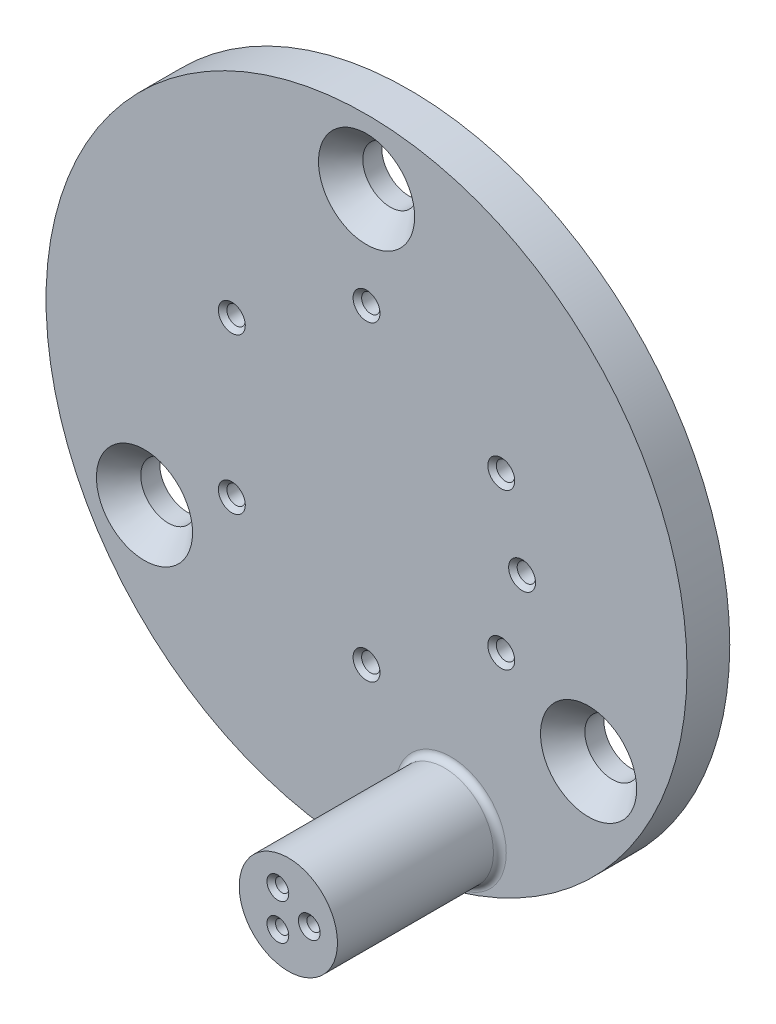
ISO-10303-21;
HEADER;
FILE_DESCRIPTION(('STEP AP214'),'2;1');
FILE_NAME('part.step','',(''),(''),'','','');
FILE_SCHEMA(('AUTOMOTIVE_DESIGN { 1 0 10303 214 1 1 1 1 }'));
ENDSEC;
DATA;
#1=APPLICATION_CONTEXT('core data for automotive mechanical design processes');
#2=APPLICATION_PROTOCOL_DEFINITION('international standard','automotive_design',2000,#1);
#3=PRODUCT_CONTEXT('',#1,'mechanical');
#4=PRODUCT('Part','Part','',(#3));
#5=PRODUCT_RELATED_PRODUCT_CATEGORY('part','',(#4));
#6=PRODUCT_DEFINITION_FORMATION('','',#4);
#7=PRODUCT_DEFINITION_CONTEXT('part definition',#1,'design');
#8=PRODUCT_DEFINITION('design','',#6,#7);
#9=PRODUCT_DEFINITION_SHAPE('','',#8);
#10=(LENGTH_UNIT() NAMED_UNIT(*) SI_UNIT(.MILLI.,.METRE.));
#11=(NAMED_UNIT(*) PLANE_ANGLE_UNIT() SI_UNIT($,.RADIAN.));
#12=(NAMED_UNIT(*) SI_UNIT($,.STERADIAN.) SOLID_ANGLE_UNIT());
#13=UNCERTAINTY_MEASURE_WITH_UNIT(LENGTH_MEASURE(1.E-05),#10,'distance_accuracy_value','');
#14=(GEOMETRIC_REPRESENTATION_CONTEXT(3) GLOBAL_UNCERTAINTY_ASSIGNED_CONTEXT((#13)) GLOBAL_UNIT_ASSIGNED_CONTEXT((#10,
#11,#12)) REPRESENTATION_CONTEXT('',''));
#15=CARTESIAN_POINT('',(0.,0.,0.));
#16=DIRECTION('',(0.,0.,1.));
#17=DIRECTION('',(1.,0.,0.));
#18=AXIS2_PLACEMENT_3D('',#15,#16,#17);
#19=CARTESIAN_POINT('',(-17.766231697773,-20.0164888256698,2.54));
#20=DIRECTION('',(0.,0.,1.));
#21=DIRECTION('',(1.,0.,0.));
#22=AXIS2_PLACEMENT_3D('',#19,#20,#21);
#23=PLANE('',#22);
#24=CARTESIAN_POINT('',(-12.7624316977741,-34.8299265362313,2.54));
#25=DIRECTION('',(0.,0.,1.));
#26=DIRECTION('',(1.,0.,0.));
#27=AXIS2_PLACEMENT_3D('',#24,#25,#26);
#28=CIRCLE('',#27,3.302);
#29=CARTESIAN_POINT('',(-9.4604316977741,-34.8299265362313,2.54));
#30=VERTEX_POINT('',#29);
#31=EDGE_CURVE('E10',#30,#30,#28,.F.);
#32=ORIENTED_EDGE('',*,*,#31,.T.);
#33=EDGE_LOOP('',(#32));
#34=FACE_BOUND('',#33,.T.);
#35=CARTESIAN_POINT('',(-9.75930722454368,-15.4350620499822,2.54));
#36=DIRECTION('',(0.,0.,1.));
#37=DIRECTION('',(1.,0.,0.));
#38=AXIS2_PLACEMENT_3D('',#35,#36,#37);
#39=CIRCLE('',#38,0.800099999999998);
#40=CARTESIAN_POINT('',(-8.95920722454368,-15.4350620499822,2.54));
#41=VERTEX_POINT('',#40);
#42=EDGE_CURVE('E142',#41,#41,#39,.F.);
#43=ORIENTED_EDGE('',*,*,#42,.T.);
#44=EDGE_LOOP('',(#43));
#45=FACE_BOUND('',#44,.T.);
#46=CARTESIAN_POINT('',(-8.52063169777308,-20.0578620499822,2.54));
#47=DIRECTION('',(0.,0.,1.));
#48=DIRECTION('',(1.,0.,0.));
#49=AXIS2_PLACEMENT_3D('',#46,#47,#48);
#50=CIRCLE('',#49,0.800099999999998);
#51=CARTESIAN_POINT('',(-7.72053169777308,-20.0578620499822,2.54));
#52=VERTEX_POINT('',#51);
#53=EDGE_CURVE('E145',#52,#52,#50,.F.);
#54=ORIENTED_EDGE('',*,*,#53,.T.);
#55=EDGE_LOOP('',(#54));
#56=FACE_BOUND('',#55,.T.);
#57=CARTESIAN_POINT('',(-9.75930722454368,-24.6806620499822,2.54));
#58=DIRECTION('',(0.,0.,1.));
#59=DIRECTION('',(1.,0.,0.));
#60=AXIS2_PLACEMENT_3D('',#57,#58,#59);
#61=CIRCLE('',#60,0.800099999999998);
#62=CARTESIAN_POINT('',(-8.95920722454368,-24.6806620499822,2.54));
#63=VERTEX_POINT('',#62);
#64=EDGE_CURVE('E148',#63,#63,#61,.F.);
#65=ORIENTED_EDGE('',*,*,#64,.T.);
#66=EDGE_LOOP('',(#65));
#67=FACE_BOUND('',#66,.T.);
#68=CARTESIAN_POINT('',(-17.7662316977731,-29.3034620499822,2.54));
#69=DIRECTION('',(0.,0.,1.));
#70=DIRECTION('',(1.,0.,0.));
#71=AXIS2_PLACEMENT_3D('',#68,#69,#70);
#72=CIRCLE('',#71,0.800099999999998);
#73=CARTESIAN_POINT('',(-16.9661316977731,-29.3034620499822,2.54));
#74=VERTEX_POINT('',#73);
#75=EDGE_CURVE('E151',#74,#74,#72,.F.);
#76=ORIENTED_EDGE('',*,*,#75,.T.);
#77=EDGE_LOOP('',(#76));
#78=FACE_BOUND('',#77,.T.);
#79=CARTESIAN_POINT('',(-25.7731561710025,-24.6806620499822,2.54));
#80=DIRECTION('',(0.,0.,1.));
#81=DIRECTION('',(1.,0.,0.));
#82=AXIS2_PLACEMENT_3D('',#79,#80,#81);
#83=CIRCLE('',#82,0.800099999999998);
#84=CARTESIAN_POINT('',(-24.9730561710025,-24.6806620499822,2.54));
#85=VERTEX_POINT('',#84);
#86=EDGE_CURVE('E154',#85,#85,#83,.F.);
#87=ORIENTED_EDGE('',*,*,#86,.T.);
#88=EDGE_LOOP('',(#87));
#89=FACE_BOUND('',#88,.T.);
#90=CARTESIAN_POINT('',(-25.7731561710025,-15.4350620499822,2.54));
#91=DIRECTION('',(0.,0.,1.));
#92=DIRECTION('',(1.,0.,0.));
#93=AXIS2_PLACEMENT_3D('',#90,#91,#92);
#94=CIRCLE('',#93,0.800099999999998);
#95=CARTESIAN_POINT('',(-24.9730561710025,-15.4350620499822,2.54));
#96=VERTEX_POINT('',#95);
#97=EDGE_CURVE('E157',#96,#96,#94,.F.);
#98=ORIENTED_EDGE('',*,*,#97,.T.);
#99=EDGE_LOOP('',(#98));
#100=FACE_BOUND('',#99,.T.);
#101=CARTESIAN_POINT('',(-17.766231697773,-10.8122620499822,2.54));
#102=DIRECTION('',(0.,0.,1.));
#103=DIRECTION('',(1.,0.,0.));
#104=AXIS2_PLACEMENT_3D('',#101,#102,#103);
#105=CIRCLE('',#104,0.800099999999998);
#106=CARTESIAN_POINT('',(-16.966131697773,-10.8122620499822,2.54));
#107=VERTEX_POINT('',#106);
#108=EDGE_CURVE('E160',#107,#107,#105,.F.);
#109=ORIENTED_EDGE('',*,*,#108,.T.);
#110=EDGE_LOOP('',(#109));
#111=FACE_BOUND('',#110,.T.);
#112=CARTESIAN_POINT('',(-17.766231697773,-20.0164888256698,2.54));
#113=DIRECTION('',(0.,0.,1.));
#114=DIRECTION('',(1.,0.,0.));
#115=AXIS2_PLACEMENT_3D('',#112,#113,#114);
#116=CIRCLE('',#115,19.05);
#117=CARTESIAN_POINT('',(1.28376830222697,-20.0164888256698,2.54));
#118=VERTEX_POINT('',#117);
#119=EDGE_CURVE('E166',#118,#118,#116,.T.);
#120=ORIENTED_EDGE('',*,*,#119,.T.);
#121=EDGE_LOOP('',(#120));
#122=FACE_BOUND('',#121,.T.);
#123=CARTESIAN_POINT('',(-4.56800454409828,-27.6778620499823,2.54));
#124=DIRECTION('',(0.,0.,1.));
#125=DIRECTION('',(1.,0.,0.));
#126=AXIS2_PLACEMENT_3D('',#123,#124,#125);
#127=CIRCLE('',#126,2.8575);
#128=CARTESIAN_POINT('',(-1.71050454409828,-27.6778620499823,2.54));
#129=VERTEX_POINT('',#128);
#130=EDGE_CURVE('E178',#129,#129,#127,.T.);
#131=ORIENTED_EDGE('',*,*,#130,.F.);
#132=EDGE_LOOP('',(#131));
#133=FACE_BOUND('',#132,.T.);
#134=CARTESIAN_POINT('',(-17.7662316977731,-4.81786204998223,2.54));
#135=DIRECTION('',(0.,0.,1.));
#136=DIRECTION('',(1.,0.,0.));
#137=AXIS2_PLACEMENT_3D('',#134,#135,#136);
#138=CIRCLE('',#137,2.8575);
#139=CARTESIAN_POINT('',(-14.9087316977731,-4.81786204998223,2.54));
#140=VERTEX_POINT('',#139);
#141=EDGE_CURVE('E187',#140,#140,#138,.T.);
#142=ORIENTED_EDGE('',*,*,#141,.F.);
#143=EDGE_LOOP('',(#142));
#144=FACE_BOUND('',#143,.T.);
#145=CARTESIAN_POINT('',(-30.9644588514479,-27.6778620499823,2.54));
#146=DIRECTION('',(0.,0.,1.));
#147=DIRECTION('',(1.,0.,0.));
#148=AXIS2_PLACEMENT_3D('',#145,#146,#147);
#149=CIRCLE('',#148,2.8575);
#150=CARTESIAN_POINT('',(-28.1069588514479,-27.6778620499823,2.54));
#151=VERTEX_POINT('',#150);
#152=EDGE_CURVE('E196',#151,#151,#149,.T.);
#153=ORIENTED_EDGE('',*,*,#152,.F.);
#154=EDGE_LOOP('',(#153));
#155=FACE_BOUND('',#154,.T.);
#156=ADVANCED_FACE('F32',(#34,#45,#56,#67,#78,#89,#100,#111,#122,#133,#144,#155),#23,.T.);
#157=CARTESIAN_POINT('',(-17.766231697773,-20.0164888256698,2.54));
#158=DIRECTION('',(0.,0.,-1.));
#159=DIRECTION('',(-1.,0.,0.));
#160=AXIS2_PLACEMENT_3D('',#157,#158,#159);
#161=CYLINDRICAL_SURFACE('',#160,19.05);
#162=ORIENTED_EDGE('',*,*,#119,.F.);
#163=EDGE_LOOP('',(#162));
#164=FACE_BOUND('',#163,.T.);
#165=CARTESIAN_POINT('',(-17.766231697773,-20.0164888256698,0.));
#166=DIRECTION('',(0.,0.,1.));
#167=DIRECTION('',(1.,0.,0.));
#168=AXIS2_PLACEMENT_3D('',#165,#166,#167);
#169=CIRCLE('',#168,19.05);
#170=CARTESIAN_POINT('',(1.28376830222697,-20.0164888256698,0.));
#171=VERTEX_POINT('',#170);
#172=EDGE_CURVE('E167',#171,#171,#169,.T.);
#173=ORIENTED_EDGE('',*,*,#172,.T.);
#174=EDGE_LOOP('',(#173));
#175=FACE_BOUND('',#174,.T.);
#176=ADVANCED_FACE('F220',(#164,#175),#161,.T.);
#177=CARTESIAN_POINT('',(-17.766231697773,-20.0164888256698,0.));
#178=DIRECTION('',(0.,0.,1.));
#179=DIRECTION('',(1.,0.,0.));
#180=AXIS2_PLACEMENT_3D('',#177,#178,#179);
#181=PLANE('',#180);
#182=CARTESIAN_POINT('',(-13.3847316977741,-35.9077817537814,0.));
#183=DIRECTION('',(0.,0.,1.));
#184=DIRECTION('',(1.,0.,0.));
#185=AXIS2_PLACEMENT_3D('',#182,#183,#184);
#186=CIRCLE('',#185,0.647699999999987);
#187=CARTESIAN_POINT('',(-12.7370316977741,-35.9077817537814,0.));
#188=VERTEX_POINT('',#187);
#189=EDGE_CURVE('E76',#188,#188,#186,.T.);
#190=ORIENTED_EDGE('',*,*,#189,.T.);
#191=EDGE_LOOP('',(#190));
#192=FACE_BOUND('',#191,.T.);
#193=CARTESIAN_POINT('',(-11.5178316977741,-34.8299265362313,0.));
#194=DIRECTION('',(0.,0.,1.));
#195=DIRECTION('',(1.,0.,0.));
#196=AXIS2_PLACEMENT_3D('',#193,#194,#195);
#197=CIRCLE('',#196,0.647699999999987);
#198=CARTESIAN_POINT('',(-10.8701316977741,-34.8299265362313,0.));
#199=VERTEX_POINT('',#198);
#200=EDGE_CURVE('E79',#199,#199,#197,.T.);
#201=ORIENTED_EDGE('',*,*,#200,.T.);
#202=EDGE_LOOP('',(#201));
#203=FACE_BOUND('',#202,.T.);
#204=CARTESIAN_POINT('',(-13.3847316977741,-33.7520713186812,0.));
#205=DIRECTION('',(0.,0.,1.));
#206=DIRECTION('',(1.,0.,0.));
#207=AXIS2_PLACEMENT_3D('',#204,#205,#206);
#208=CIRCLE('',#207,0.647699999999987);
#209=CARTESIAN_POINT('',(-12.7370316977741,-33.7520713186812,0.));
#210=VERTEX_POINT('',#209);
#211=EDGE_CURVE('E82',#210,#210,#208,.T.);
#212=ORIENTED_EDGE('',*,*,#211,.T.);
#213=EDGE_LOOP('',(#212));
#214=FACE_BOUND('',#213,.T.);
#215=CARTESIAN_POINT('',(-9.75930722454368,-24.6806620499822,0.));
#216=DIRECTION('',(0.,0.,1.));
#217=DIRECTION('',(1.,0.,0.));
#218=AXIS2_PLACEMENT_3D('',#215,#216,#217);
#219=CIRCLE('',#218,0.800099999999998);
#220=CARTESIAN_POINT('',(-8.95920722454368,-24.6806620499822,0.));
#221=VERTEX_POINT('',#220);
#222=EDGE_CURVE('E85',#221,#221,#219,.T.);
#223=ORIENTED_EDGE('',*,*,#222,.T.);
#224=EDGE_LOOP('',(#223));
#225=FACE_BOUND('',#224,.T.);
#226=CARTESIAN_POINT('',(-17.7662316977731,-29.3034620499822,0.));
#227=DIRECTION('',(0.,0.,1.));
#228=DIRECTION('',(1.,0.,0.));
#229=AXIS2_PLACEMENT_3D('',#226,#227,#228);
#230=CIRCLE('',#229,0.800099999999998);
#231=CARTESIAN_POINT('',(-16.9661316977731,-29.3034620499822,0.));
#232=VERTEX_POINT('',#231);
#233=EDGE_CURVE('E88',#232,#232,#230,.T.);
#234=ORIENTED_EDGE('',*,*,#233,.T.);
#235=EDGE_LOOP('',(#234));
#236=FACE_BOUND('',#235,.T.);
#237=CARTESIAN_POINT('',(-25.7731561710025,-24.6806620499822,0.));
#238=DIRECTION('',(0.,0.,1.));
#239=DIRECTION('',(1.,0.,0.));
#240=AXIS2_PLACEMENT_3D('',#237,#238,#239);
#241=CIRCLE('',#240,0.800099999999998);
#242=CARTESIAN_POINT('',(-24.9730561710025,-24.6806620499822,0.));
#243=VERTEX_POINT('',#242);
#244=EDGE_CURVE('E91',#243,#243,#241,.T.);
#245=ORIENTED_EDGE('',*,*,#244,.T.);
#246=EDGE_LOOP('',(#245));
#247=FACE_BOUND('',#246,.T.);
#248=CARTESIAN_POINT('',(-25.7731561710025,-15.4350620499822,0.));
#249=DIRECTION('',(0.,0.,1.));
#250=DIRECTION('',(1.,0.,0.));
#251=AXIS2_PLACEMENT_3D('',#248,#249,#250);
#252=CIRCLE('',#251,0.800099999999998);
#253=CARTESIAN_POINT('',(-24.9730561710025,-15.4350620499822,0.));
#254=VERTEX_POINT('',#253);
#255=EDGE_CURVE('E94',#254,#254,#252,.T.);
#256=ORIENTED_EDGE('',*,*,#255,.T.);
#257=EDGE_LOOP('',(#256));
#258=FACE_BOUND('',#257,.T.);
#259=CARTESIAN_POINT('',(-8.52063169777308,-20.0578620499822,0.));
#260=DIRECTION('',(0.,0.,1.));
#261=DIRECTION('',(1.,0.,0.));
#262=AXIS2_PLACEMENT_3D('',#259,#260,#261);
#263=CIRCLE('',#262,0.800099999999998);
#264=CARTESIAN_POINT('',(-7.72053169777308,-20.0578620499822,0.));
#265=VERTEX_POINT('',#264);
#266=EDGE_CURVE('E97',#265,#265,#263,.T.);
#267=ORIENTED_EDGE('',*,*,#266,.T.);
#268=EDGE_LOOP('',(#267));
#269=FACE_BOUND('',#268,.T.);
#270=CARTESIAN_POINT('',(-9.75930722454368,-15.4350620499822,0.));
#271=DIRECTION('',(0.,0.,1.));
#272=DIRECTION('',(1.,0.,0.));
#273=AXIS2_PLACEMENT_3D('',#270,#271,#272);
#274=CIRCLE('',#273,0.800099999999998);
#275=CARTESIAN_POINT('',(-8.95920722454368,-15.4350620499822,0.));
#276=VERTEX_POINT('',#275);
#277=EDGE_CURVE('E100',#276,#276,#274,.T.);
#278=ORIENTED_EDGE('',*,*,#277,.T.);
#279=EDGE_LOOP('',(#278));
#280=FACE_BOUND('',#279,.T.);
#281=CARTESIAN_POINT('',(-17.766231697773,-10.8122620499822,0.));
#282=DIRECTION('',(0.,0.,1.));
#283=DIRECTION('',(1.,0.,0.));
#284=AXIS2_PLACEMENT_3D('',#281,#282,#283);
#285=CIRCLE('',#284,0.800099999999998);
#286=CARTESIAN_POINT('',(-16.966131697773,-10.8122620499822,0.));
#287=VERTEX_POINT('',#286);
#288=EDGE_CURVE('E103',#287,#287,#285,.T.);
#289=ORIENTED_EDGE('',*,*,#288,.T.);
#290=EDGE_LOOP('',(#289));
#291=FACE_BOUND('',#290,.T.);
#292=CARTESIAN_POINT('',(-30.9644588514479,-27.6778620499823,0.));
#293=DIRECTION('',(0.,0.,1.));
#294=DIRECTION('',(1.,0.,0.));
#295=AXIS2_PLACEMENT_3D('',#292,#293,#294);
#296=CIRCLE('',#295,1.63195);
#297=CARTESIAN_POINT('',(-29.3325088514479,-27.6778620499823,0.));
#298=VERTEX_POINT('',#297);
#299=EDGE_CURVE('E190',#298,#298,#296,.T.);
#300=ORIENTED_EDGE('',*,*,#299,.T.);
#301=EDGE_LOOP('',(#300));
#302=FACE_BOUND('',#301,.T.);
#303=CARTESIAN_POINT('',(-17.7662316977731,-4.81786204998223,0.));
#304=DIRECTION('',(0.,0.,1.));
#305=DIRECTION('',(1.,0.,0.));
#306=AXIS2_PLACEMENT_3D('',#303,#304,#305);
#307=CIRCLE('',#306,1.63195);
#308=CARTESIAN_POINT('',(-16.1342816977731,-4.81786204998223,0.));
#309=VERTEX_POINT('',#308);
#310=EDGE_CURVE('E181',#309,#309,#307,.T.);
#311=ORIENTED_EDGE('',*,*,#310,.T.);
#312=EDGE_LOOP('',(#311));
#313=FACE_BOUND('',#312,.T.);
#314=CARTESIAN_POINT('',(-4.56800454409828,-27.6778620499823,0.));
#315=DIRECTION('',(0.,0.,1.));
#316=DIRECTION('',(1.,0.,0.));
#317=AXIS2_PLACEMENT_3D('',#314,#315,#316);
#318=CIRCLE('',#317,1.63195);
#319=CARTESIAN_POINT('',(-2.93605454409828,-27.6778620499823,0.));
#320=VERTEX_POINT('',#319);
#321=EDGE_CURVE('E170',#320,#320,#318,.T.);
#322=ORIENTED_EDGE('',*,*,#321,.T.);
#323=EDGE_LOOP('',(#322));
#324=FACE_BOUND('',#323,.T.);
#325=ORIENTED_EDGE('',*,*,#172,.F.);
#326=EDGE_LOOP('',(#325));
#327=FACE_BOUND('',#326,.T.);
#328=ADVANCED_FACE('F225',(#192,#203,#214,#225,#236,#247,#258,#269,#280,#291,#302,#313,#324,
#327),#181,.F.);
#329=CARTESIAN_POINT('',(-4.56800454409828,-27.6778620499823,2.54));
#330=DIRECTION('',(0.,0.,1.));
#331=DIRECTION('',(1.,0.,0.));
#332=AXIS2_PLACEMENT_3D('',#329,#330,#331);
#333=CYLINDRICAL_SURFACE('',#332,1.63195);
#334=ORIENTED_EDGE('',*,*,#321,.F.);
#335=EDGE_LOOP('',(#334));
#336=FACE_BOUND('',#335,.T.);
#337=CARTESIAN_POINT('',(-4.56800454409828,-27.6778620499823,1.13016599853029));
#338=DIRECTION('',(0.,0.,1.));
#339=DIRECTION('',(1.,0.,0.));
#340=AXIS2_PLACEMENT_3D('',#337,#338,#339);
#341=CIRCLE('',#340,1.63195);
#342=CARTESIAN_POINT('',(-2.93605454409828,-27.6778620499823,1.13016599853029));
#343=VERTEX_POINT('',#342);
#344=EDGE_CURVE('E175',#343,#343,#341,.T.);
#345=ORIENTED_EDGE('',*,*,#344,.T.);
#346=EDGE_LOOP('',(#345));
#347=FACE_BOUND('',#346,.T.);
#348=ADVANCED_FACE('F231',(#336,#347),#333,.F.);
#349=CARTESIAN_POINT('',(-4.56800454409828,-27.6778620499823,2.54));
#350=DIRECTION('',(0.,0.,1.));
#351=DIRECTION('',(1.,0.,0.));
#352=AXIS2_PLACEMENT_3D('',#349,#350,#351);
#353=CONICAL_SURFACE('',#352,2.8575,0.715584993317675);
#354=ORIENTED_EDGE('',*,*,#344,.F.);
#355=EDGE_LOOP('',(#354));
#356=FACE_BOUND('',#355,.T.);
#357=ORIENTED_EDGE('',*,*,#130,.T.);
#358=EDGE_LOOP('',(#357));
#359=FACE_BOUND('',#358,.T.);
#360=ADVANCED_FACE('F335',(#356,#359),#353,.F.);
#361=CARTESIAN_POINT('',(-17.7662316977731,-4.81786204998223,2.54));
#362=DIRECTION('',(0.,0.,1.));
#363=DIRECTION('',(1.,0.,0.));
#364=AXIS2_PLACEMENT_3D('',#361,#362,#363);
#365=CYLINDRICAL_SURFACE('',#364,1.63195);
#366=ORIENTED_EDGE('',*,*,#310,.F.);
#367=EDGE_LOOP('',(#366));
#368=FACE_BOUND('',#367,.T.);
#369=CARTESIAN_POINT('',(-17.7662316977731,-4.81786204998223,1.13016599853029));
#370=DIRECTION('',(0.,0.,1.));
#371=DIRECTION('',(1.,0.,0.));
#372=AXIS2_PLACEMENT_3D('',#369,#370,#371);
#373=CIRCLE('',#372,1.63195);
#374=CARTESIAN_POINT('',(-16.1342816977731,-4.81786204998223,1.13016599853029));
#375=VERTEX_POINT('',#374);
#376=EDGE_CURVE('E184',#375,#375,#373,.T.);
#377=ORIENTED_EDGE('',*,*,#376,.T.);
#378=EDGE_LOOP('',(#377));
#379=FACE_BOUND('',#378,.T.);
#380=ADVANCED_FACE('F340',(#368,#379),#365,.F.);
#381=CARTESIAN_POINT('',(-17.7662316977731,-4.81786204998223,2.54));
#382=DIRECTION('',(0.,0.,1.));
#383=DIRECTION('',(1.,0.,0.));
#384=AXIS2_PLACEMENT_3D('',#381,#382,#383);
#385=CONICAL_SURFACE('',#384,2.8575,0.715584993317674);
#386=ORIENTED_EDGE('',*,*,#376,.F.);
#387=EDGE_LOOP('',(#386));
#388=FACE_BOUND('',#387,.T.);
#389=ORIENTED_EDGE('',*,*,#141,.T.);
#390=EDGE_LOOP('',(#389));
#391=FACE_BOUND('',#390,.T.);
#392=ADVANCED_FACE('F361',(#388,#391),#385,.F.);
#393=CARTESIAN_POINT('',(-30.9644588514479,-27.6778620499823,2.54));
#394=DIRECTION('',(0.,0.,1.));
#395=DIRECTION('',(1.,0.,0.));
#396=AXIS2_PLACEMENT_3D('',#393,#394,#395);
#397=CYLINDRICAL_SURFACE('',#396,1.63195);
#398=ORIENTED_EDGE('',*,*,#299,.F.);
#399=EDGE_LOOP('',(#398));
#400=FACE_BOUND('',#399,.T.);
#401=CARTESIAN_POINT('',(-30.9644588514479,-27.6778620499823,1.13016599853029));
#402=DIRECTION('',(0.,0.,1.));
#403=DIRECTION('',(1.,0.,0.));
#404=AXIS2_PLACEMENT_3D('',#401,#402,#403);
#405=CIRCLE('',#404,1.63195);
#406=CARTESIAN_POINT('',(-29.3325088514479,-27.6778620499823,1.13016599853029));
#407=VERTEX_POINT('',#406);
#408=EDGE_CURVE('E193',#407,#407,#405,.T.);
#409=ORIENTED_EDGE('',*,*,#408,.T.);
#410=EDGE_LOOP('',(#409));
#411=FACE_BOUND('',#410,.T.);
#412=ADVANCED_FACE('F351',(#400,#411),#397,.F.);
#413=CARTESIAN_POINT('',(-30.9644588514479,-27.6778620499823,2.54));
#414=DIRECTION('',(0.,0.,1.));
#415=DIRECTION('',(1.,0.,0.));
#416=AXIS2_PLACEMENT_3D('',#413,#414,#415);
#417=CONICAL_SURFACE('',#416,2.8575,0.715584993317674);
#418=ORIENTED_EDGE('',*,*,#408,.F.);
#419=EDGE_LOOP('',(#418));
#420=FACE_BOUND('',#419,.T.);
#421=ORIENTED_EDGE('',*,*,#152,.T.);
#422=EDGE_LOOP('',(#421));
#423=FACE_BOUND('',#422,.T.);
#424=ADVANCED_FACE('F348',(#420,#423),#417,.F.);
#425=CARTESIAN_POINT('',(-25.7731561710025,-24.6806620499822,2.54));
#426=DIRECTION('',(0.,0.,1.));
#427=DIRECTION('',(1.,0.,0.));
#428=AXIS2_PLACEMENT_3D('',#425,#426,#427);
#429=CYLINDRICAL_SURFACE('',#428,0.546100000000001);
#430=CARTESIAN_POINT('',(-25.7731561710025,-24.6806620499822,0.253999999999999));
#431=DIRECTION('',(0.,0.,1.));
#432=DIRECTION('',(1.,0.,0.));
#433=AXIS2_PLACEMENT_3D('',#430,#431,#432);
#434=CIRCLE('',#433,0.546100000000001);
#435=CARTESIAN_POINT('',(-25.2270561710025,-24.6806620499822,0.253999999999999));
#436=VERTEX_POINT('',#435);
#437=EDGE_CURVE('E58',#436,#436,#434,.F.);
#438=ORIENTED_EDGE('',*,*,#437,.T.);
#439=EDGE_LOOP('',(#438));
#440=FACE_BOUND('',#439,.T.);
#441=CARTESIAN_POINT('',(-25.7731561710025,-24.6806620499822,2.28600000000001));
#442=DIRECTION('',(0.,0.,1.));
#443=DIRECTION('',(1.,0.,0.));
#444=AXIS2_PLACEMENT_3D('',#441,#442,#443);
#445=CIRCLE('',#444,0.546100000000001);
#446=CARTESIAN_POINT('',(-25.2270561710025,-24.6806620499822,2.28600000000001));
#447=VERTEX_POINT('',#446);
#448=EDGE_CURVE('E130',#447,#447,#445,.T.);
#449=ORIENTED_EDGE('',*,*,#448,.T.);
#450=EDGE_LOOP('',(#449));
#451=FACE_BOUND('',#450,.T.);
#452=ADVANCED_FACE('F350',(#440,#451),#429,.F.);
#453=CARTESIAN_POINT('',(-17.7662316977731,-29.3034620499822,2.54));
#454=DIRECTION('',(0.,0.,1.));
#455=DIRECTION('',(1.,0.,0.));
#456=AXIS2_PLACEMENT_3D('',#453,#454,#455);
#457=CYLINDRICAL_SURFACE('',#456,0.546100000000001);
#458=CARTESIAN_POINT('',(-17.7662316977731,-29.3034620499822,0.253999999999999));
#459=DIRECTION('',(0.,0.,1.));
#460=DIRECTION('',(1.,0.,0.));
#461=AXIS2_PLACEMENT_3D('',#458,#459,#460);
#462=CIRCLE('',#461,0.546100000000001);
#463=CARTESIAN_POINT('',(-17.2201316977731,-29.3034620499822,0.253999999999999));
#464=VERTEX_POINT('',#463);
#465=EDGE_CURVE('E61',#464,#464,#462,.F.);
#466=ORIENTED_EDGE('',*,*,#465,.T.);
#467=EDGE_LOOP('',(#466));
#468=FACE_BOUND('',#467,.T.);
#469=CARTESIAN_POINT('',(-17.7662316977731,-29.3034620499822,2.28600000000001));
#470=DIRECTION('',(0.,0.,1.));
#471=DIRECTION('',(1.,0.,0.));
#472=AXIS2_PLACEMENT_3D('',#469,#470,#471);
#473=CIRCLE('',#472,0.546100000000001);
#474=CARTESIAN_POINT('',(-17.2201316977731,-29.3034620499822,2.28600000000001));
#475=VERTEX_POINT('',#474);
#476=EDGE_CURVE('E133',#475,#475,#473,.T.);
#477=ORIENTED_EDGE('',*,*,#476,.T.);
#478=EDGE_LOOP('',(#477));
#479=FACE_BOUND('',#478,.T.);
#480=ADVANCED_FACE('F358',(#468,#479),#457,.F.);
#481=CARTESIAN_POINT('',(-9.75930722454368,-24.6806620499822,2.54));
#482=DIRECTION('',(0.,0.,1.));
#483=DIRECTION('',(1.,0.,0.));
#484=AXIS2_PLACEMENT_3D('',#481,#482,#483);
#485=CYLINDRICAL_SURFACE('',#484,0.546099999999999);
#486=CARTESIAN_POINT('',(-9.75930722454368,-24.6806620499822,0.254));
#487=DIRECTION('',(0.,0.,1.));
#488=DIRECTION('',(1.,0.,0.));
#489=AXIS2_PLACEMENT_3D('',#486,#487,#488);
#490=CIRCLE('',#489,0.546099999999999);
#491=CARTESIAN_POINT('',(-9.21320722454368,-24.6806620499822,0.254));
#492=VERTEX_POINT('',#491);
#493=EDGE_CURVE('E64',#492,#492,#490,.F.);
#494=ORIENTED_EDGE('',*,*,#493,.T.);
#495=EDGE_LOOP('',(#494));
#496=FACE_BOUND('',#495,.T.);
#497=CARTESIAN_POINT('',(-9.75930722454368,-24.6806620499822,2.28600000000001));
#498=DIRECTION('',(0.,0.,1.));
#499=DIRECTION('',(1.,0.,0.));
#500=AXIS2_PLACEMENT_3D('',#497,#498,#499);
#501=CIRCLE('',#500,0.546099999999999);
#502=CARTESIAN_POINT('',(-9.21320722454368,-24.6806620499822,2.28600000000001));
#503=VERTEX_POINT('',#502);
#504=EDGE_CURVE('E136',#503,#503,#501,.T.);
#505=ORIENTED_EDGE('',*,*,#504,.T.);
#506=EDGE_LOOP('',(#505));
#507=FACE_BOUND('',#506,.T.);
#508=ADVANCED_FACE('F486',(#496,#507),#485,.F.);
#509=CARTESIAN_POINT('',(-8.52063169777308,-20.0578620499822,2.54));
#510=DIRECTION('',(0.,0.,1.));
#511=DIRECTION('',(1.,0.,0.));
#512=AXIS2_PLACEMENT_3D('',#509,#510,#511);
#513=CYLINDRICAL_SURFACE('',#512,0.546099999999999);
#514=CARTESIAN_POINT('',(-8.52063169777308,-20.0578620499822,0.254));
#515=DIRECTION('',(0.,0.,1.));
#516=DIRECTION('',(1.,0.,0.));
#517=AXIS2_PLACEMENT_3D('',#514,#515,#516);
#518=CIRCLE('',#517,0.546099999999999);
#519=CARTESIAN_POINT('',(-7.97453169777308,-20.0578620499822,0.254));
#520=VERTEX_POINT('',#519);
#521=EDGE_CURVE('E52',#520,#520,#518,.F.);
#522=ORIENTED_EDGE('',*,*,#521,.T.);
#523=EDGE_LOOP('',(#522));
#524=FACE_BOUND('',#523,.T.);
#525=CARTESIAN_POINT('',(-8.52063169777308,-20.0578620499822,2.28600000000001));
#526=DIRECTION('',(0.,0.,1.));
#527=DIRECTION('',(1.,0.,0.));
#528=AXIS2_PLACEMENT_3D('',#525,#526,#527);
#529=CIRCLE('',#528,0.546099999999999);
#530=CARTESIAN_POINT('',(-7.97453169777308,-20.0578620499822,2.28600000000001));
#531=VERTEX_POINT('',#530);
#532=EDGE_CURVE('E139',#531,#531,#529,.T.);
#533=ORIENTED_EDGE('',*,*,#532,.T.);
#534=EDGE_LOOP('',(#533));
#535=FACE_BOUND('',#534,.T.);
#536=ADVANCED_FACE('F495',(#524,#535),#513,.F.);
#537=CARTESIAN_POINT('',(-9.75930722454368,-15.4350620499822,2.54));
#538=DIRECTION('',(0.,0.,1.));
#539=DIRECTION('',(1.,0.,0.));
#540=AXIS2_PLACEMENT_3D('',#537,#538,#539);
#541=CYLINDRICAL_SURFACE('',#540,0.546099999999999);
#542=CARTESIAN_POINT('',(-9.75930722454368,-15.4350620499822,0.254));
#543=DIRECTION('',(0.,0.,1.));
#544=DIRECTION('',(1.,0.,0.));
#545=AXIS2_PLACEMENT_3D('',#542,#543,#544);
#546=CIRCLE('',#545,0.546099999999999);
#547=CARTESIAN_POINT('',(-9.21320722454368,-15.4350620499822,0.254));
#548=VERTEX_POINT('',#547);
#549=EDGE_CURVE('E47',#548,#548,#546,.F.);
#550=ORIENTED_EDGE('',*,*,#549,.T.);
#551=EDGE_LOOP('',(#550));
#552=FACE_BOUND('',#551,.T.);
#553=CARTESIAN_POINT('',(-9.75930722454368,-15.4350620499822,2.28600000000001));
#554=DIRECTION('',(0.,0.,1.));
#555=DIRECTION('',(1.,0.,0.));
#556=AXIS2_PLACEMENT_3D('',#553,#554,#555);
#557=CIRCLE('',#556,0.546099999999999);
#558=CARTESIAN_POINT('',(-9.21320722454368,-15.4350620499822,2.28600000000001));
#559=VERTEX_POINT('',#558);
#560=EDGE_CURVE('E163',#559,#559,#557,.T.);
#561=ORIENTED_EDGE('',*,*,#560,.T.);
#562=EDGE_LOOP('',(#561));
#563=FACE_BOUND('',#562,.T.);
#564=ADVANCED_FACE('F505',(#552,#563),#541,.F.);
#565=CARTESIAN_POINT('',(-25.7731561710025,-15.4350620499822,2.54));
#566=DIRECTION('',(0.,0.,1.));
#567=DIRECTION('',(1.,0.,0.));
#568=AXIS2_PLACEMENT_3D('',#565,#566,#567);
#569=CYLINDRICAL_SURFACE('',#568,0.546100000000001);
#570=CARTESIAN_POINT('',(-25.7731561710025,-15.4350620499822,0.253999999999999));
#571=DIRECTION('',(0.,0.,1.));
#572=DIRECTION('',(1.,0.,0.));
#573=AXIS2_PLACEMENT_3D('',#570,#571,#572);
#574=CIRCLE('',#573,0.546100000000001);
#575=CARTESIAN_POINT('',(-25.2270561710025,-15.4350620499822,0.253999999999999));
#576=VERTEX_POINT('',#575);
#577=EDGE_CURVE('E55',#576,#576,#574,.F.);
#578=ORIENTED_EDGE('',*,*,#577,.T.);
#579=EDGE_LOOP('',(#578));
#580=FACE_BOUND('',#579,.T.);
#581=CARTESIAN_POINT('',(-25.7731561710025,-15.4350620499822,2.28600000000001));
#582=DIRECTION('',(0.,0.,1.));
#583=DIRECTION('',(1.,0.,0.));
#584=AXIS2_PLACEMENT_3D('',#581,#582,#583);
#585=CIRCLE('',#584,0.546100000000001);
#586=CARTESIAN_POINT('',(-25.2270561710025,-15.4350620499822,2.28600000000001));
#587=VERTEX_POINT('',#586);
#588=EDGE_CURVE('E127',#587,#587,#585,.T.);
#589=ORIENTED_EDGE('',*,*,#588,.T.);
#590=EDGE_LOOP('',(#589));
#591=FACE_BOUND('',#590,.T.);
#592=ADVANCED_FACE('F216',(#580,#591),#569,.F.);
#593=CARTESIAN_POINT('',(-17.766231697773,-10.8122620499822,2.54));
#594=DIRECTION('',(0.,0.,1.));
#595=DIRECTION('',(1.,0.,0.));
#596=AXIS2_PLACEMENT_3D('',#593,#594,#595);
#597=CYLINDRICAL_SURFACE('',#596,0.546100000000001);
#598=CARTESIAN_POINT('',(-17.766231697773,-10.8122620499822,0.253999999999999));
#599=DIRECTION('',(0.,0.,1.));
#600=DIRECTION('',(1.,0.,0.));
#601=AXIS2_PLACEMENT_3D('',#598,#599,#600);
#602=CIRCLE('',#601,0.546100000000001);
#603=CARTESIAN_POINT('',(-17.220131697773,-10.8122620499822,0.253999999999999));
#604=VERTEX_POINT('',#603);
#605=EDGE_CURVE('E43',#604,#604,#602,.F.);
#606=ORIENTED_EDGE('',*,*,#605,.T.);
#607=EDGE_LOOP('',(#606));
#608=FACE_BOUND('',#607,.T.);
#609=CARTESIAN_POINT('',(-17.766231697773,-10.8122620499822,2.28600000000001));
#610=DIRECTION('',(0.,0.,1.));
#611=DIRECTION('',(1.,0.,0.));
#612=AXIS2_PLACEMENT_3D('',#609,#610,#611);
#613=CIRCLE('',#612,0.546100000000001);
#614=CARTESIAN_POINT('',(-17.220131697773,-10.8122620499822,2.28600000000001));
#615=VERTEX_POINT('',#614);
#616=EDGE_CURVE('E124',#615,#615,#613,.T.);
#617=ORIENTED_EDGE('',*,*,#616,.T.);
#618=EDGE_LOOP('',(#617));
#619=FACE_BOUND('',#618,.T.);
#620=ADVANCED_FACE('F207',(#608,#619),#597,.F.);
#621=CARTESIAN_POINT('',(-12.7624316977741,-34.8299265362313,12.192));
#622=DIRECTION('',(0.,0.,-1.));
#623=DIRECTION('',(-1.,0.,0.));
#624=AXIS2_PLACEMENT_3D('',#621,#622,#623);
#625=CYLINDRICAL_SURFACE('',#624,2.921);
#626=CARTESIAN_POINT('',(-12.7624316977741,-34.8299265362313,2.921));
#627=DIRECTION('',(0.,0.,1.));
#628=DIRECTION('',(1.,0.,0.));
#629=AXIS2_PLACEMENT_3D('',#626,#627,#628);
#630=CIRCLE('',#629,2.921);
#631=CARTESIAN_POINT('',(-9.8414316977741,-34.8299265362313,2.921));
#632=VERTEX_POINT('',#631);
#633=EDGE_CURVE('E39',#632,#632,#630,.T.);
#634=ORIENTED_EDGE('',*,*,#633,.T.);
#635=EDGE_LOOP('',(#634));
#636=FACE_BOUND('',#635,.T.);
#637=CARTESIAN_POINT('',(-12.7624316977741,-34.8299265362313,12.192));
#638=DIRECTION('',(0.,0.,1.));
#639=DIRECTION('',(1.,0.,0.));
#640=AXIS2_PLACEMENT_3D('',#637,#638,#639);
#641=CIRCLE('',#640,2.921);
#642=CARTESIAN_POINT('',(-9.8414316977741,-34.8299265362313,12.192));
#643=VERTEX_POINT('',#642);
#644=EDGE_CURVE('E199',#643,#643,#641,.T.);
#645=ORIENTED_EDGE('',*,*,#644,.F.);
#646=EDGE_LOOP('',(#645));
#647=FACE_BOUND('',#646,.T.);
#648=ADVANCED_FACE('F205',(#636,#647),#625,.T.);
#649=CARTESIAN_POINT('',(-12.7624316977741,-34.8299265362313,12.192));
#650=DIRECTION('',(0.,0.,1.));
#651=DIRECTION('',(1.,0.,0.));
#652=AXIS2_PLACEMENT_3D('',#649,#650,#651);
#653=PLANE('',#652);
#654=CARTESIAN_POINT('',(-11.5178316977741,-34.8299265362313,12.192));
#655=DIRECTION('',(0.,0.,1.));
#656=DIRECTION('',(1.,0.,0.));
#657=AXIS2_PLACEMENT_3D('',#654,#655,#656);
#658=CIRCLE('',#657,0.647699999999994);
#659=CARTESIAN_POINT('',(-10.8701316977741,-34.8299265362313,12.192));
#660=VERTEX_POINT('',#659);
#661=EDGE_CURVE('E112',#660,#660,#658,.F.);
#662=ORIENTED_EDGE('',*,*,#661,.T.);
#663=EDGE_LOOP('',(#662));
#664=FACE_BOUND('',#663,.T.);
#665=CARTESIAN_POINT('',(-13.3847316977741,-35.9077817537814,12.192));
#666=DIRECTION('',(0.,0.,1.));
#667=DIRECTION('',(1.,0.,0.));
#668=AXIS2_PLACEMENT_3D('',#665,#666,#667);
#669=CIRCLE('',#668,0.647699999999994);
#670=CARTESIAN_POINT('',(-12.7370316977741,-35.9077817537814,12.192));
#671=VERTEX_POINT('',#670);
#672=EDGE_CURVE('E115',#671,#671,#669,.F.);
#673=ORIENTED_EDGE('',*,*,#672,.T.);
#674=EDGE_LOOP('',(#673));
#675=FACE_BOUND('',#674,.T.);
#676=CARTESIAN_POINT('',(-13.3847316977741,-33.7520713186812,12.192));
#677=DIRECTION('',(0.,0.,1.));
#678=DIRECTION('',(1.,0.,0.));
#679=AXIS2_PLACEMENT_3D('',#676,#677,#678);
#680=CIRCLE('',#679,0.647699999999994);
#681=CARTESIAN_POINT('',(-12.7370316977741,-33.7520713186812,12.192));
#682=VERTEX_POINT('',#681);
#683=EDGE_CURVE('E118',#682,#682,#680,.F.);
#684=ORIENTED_EDGE('',*,*,#683,.T.);
#685=EDGE_LOOP('',(#684));
#686=FACE_BOUND('',#685,.T.);
#687=ORIENTED_EDGE('',*,*,#644,.T.);
#688=EDGE_LOOP('',(#687));
#689=FACE_BOUND('',#688,.T.);
#690=ADVANCED_FACE('F203',(#664,#675,#686,#689),#653,.T.);
#691=CARTESIAN_POINT('',(-9.75930722454368,-15.4350620499822,2.28600000000001));
#692=DIRECTION('',(0.,0.,1.));
#693=DIRECTION('',(1.,0.,0.));
#694=AXIS2_PLACEMENT_3D('',#691,#692,#693);
#695=CONICAL_SURFACE('',#694,0.546099999999999,0.785398163397459);
#696=ORIENTED_EDGE('',*,*,#42,.F.);
#697=EDGE_LOOP('',(#696));
#698=FACE_BOUND('',#697,.T.);
#699=ORIENTED_EDGE('',*,*,#560,.F.);
#700=EDGE_LOOP('',(#699));
#701=FACE_BOUND('',#700,.T.);
#702=ADVANCED_FACE('F213',(#698,#701),#695,.F.);
#703=CARTESIAN_POINT('',(-8.52063169777308,-20.0578620499822,2.28600000000001));
#704=DIRECTION('',(0.,0.,1.));
#705=DIRECTION('',(1.,0.,0.));
#706=AXIS2_PLACEMENT_3D('',#703,#704,#705);
#707=CONICAL_SURFACE('',#706,0.546099999999999,0.785398163397459);
#708=ORIENTED_EDGE('',*,*,#53,.F.);
#709=EDGE_LOOP('',(#708));
#710=FACE_BOUND('',#709,.T.);
#711=ORIENTED_EDGE('',*,*,#532,.F.);
#712=EDGE_LOOP('',(#711));
#713=FACE_BOUND('',#712,.T.);
#714=ADVANCED_FACE('F238',(#710,#713),#707,.F.);
#715=CARTESIAN_POINT('',(-9.75930722454368,-24.6806620499822,2.28600000000001));
#716=DIRECTION('',(0.,0.,1.));
#717=DIRECTION('',(1.,0.,0.));
#718=AXIS2_PLACEMENT_3D('',#715,#716,#717);
#719=CONICAL_SURFACE('',#718,0.546099999999999,0.785398163397459);
#720=ORIENTED_EDGE('',*,*,#64,.F.);
#721=EDGE_LOOP('',(#720));
#722=FACE_BOUND('',#721,.T.);
#723=ORIENTED_EDGE('',*,*,#504,.F.);
#724=EDGE_LOOP('',(#723));
#725=FACE_BOUND('',#724,.T.);
#726=ADVANCED_FACE('F242',(#722,#725),#719,.F.);
#727=CARTESIAN_POINT('',(-17.7662316977731,-29.3034620499822,2.28600000000001));
#728=DIRECTION('',(0.,0.,1.));
#729=DIRECTION('',(1.,0.,0.));
#730=AXIS2_PLACEMENT_3D('',#727,#728,#729);
#731=CONICAL_SURFACE('',#730,0.546100000000001,0.785398163397458);
#732=ORIENTED_EDGE('',*,*,#75,.F.);
#733=EDGE_LOOP('',(#732));
#734=FACE_BOUND('',#733,.T.);
#735=ORIENTED_EDGE('',*,*,#476,.F.);
#736=EDGE_LOOP('',(#735));
#737=FACE_BOUND('',#736,.T.);
#738=ADVANCED_FACE('F246',(#734,#737),#731,.F.);
#739=CARTESIAN_POINT('',(-25.7731561710025,-24.6806620499822,2.28600000000001));
#740=DIRECTION('',(0.,0.,1.));
#741=DIRECTION('',(1.,0.,0.));
#742=AXIS2_PLACEMENT_3D('',#739,#740,#741);
#743=CONICAL_SURFACE('',#742,0.546100000000001,0.785398163397458);
#744=ORIENTED_EDGE('',*,*,#86,.F.);
#745=EDGE_LOOP('',(#744));
#746=FACE_BOUND('',#745,.T.);
#747=ORIENTED_EDGE('',*,*,#448,.F.);
#748=EDGE_LOOP('',(#747));
#749=FACE_BOUND('',#748,.T.);
#750=ADVANCED_FACE('F250',(#746,#749),#743,.F.);
#751=CARTESIAN_POINT('',(-25.7731561710025,-15.4350620499822,2.28600000000001));
#752=DIRECTION('',(0.,0.,1.));
#753=DIRECTION('',(1.,0.,0.));
#754=AXIS2_PLACEMENT_3D('',#751,#752,#753);
#755=CONICAL_SURFACE('',#754,0.546100000000001,0.785398163397458);
#756=ORIENTED_EDGE('',*,*,#97,.F.);
#757=EDGE_LOOP('',(#756));
#758=FACE_BOUND('',#757,.T.);
#759=ORIENTED_EDGE('',*,*,#588,.F.);
#760=EDGE_LOOP('',(#759));
#761=FACE_BOUND('',#760,.T.);
#762=ADVANCED_FACE('F254',(#758,#761),#755,.F.);
#763=CARTESIAN_POINT('',(-17.766231697773,-10.8122620499822,2.28600000000001));
#764=DIRECTION('',(0.,0.,1.));
#765=DIRECTION('',(1.,0.,0.));
#766=AXIS2_PLACEMENT_3D('',#763,#764,#765);
#767=CONICAL_SURFACE('',#766,0.546100000000001,0.785398163397458);
#768=ORIENTED_EDGE('',*,*,#108,.F.);
#769=EDGE_LOOP('',(#768));
#770=FACE_BOUND('',#769,.T.);
#771=ORIENTED_EDGE('',*,*,#616,.F.);
#772=EDGE_LOOP('',(#771));
#773=FACE_BOUND('',#772,.T.);
#774=ADVANCED_FACE('F258',(#770,#773),#767,.F.);
#775=CARTESIAN_POINT('',(-11.5178316977741,-34.8299265362313,12.192));
#776=DIRECTION('',(0.,0.,1.));
#777=DIRECTION('',(1.,0.,0.));
#778=AXIS2_PLACEMENT_3D('',#775,#776,#777);
#779=CYLINDRICAL_SURFACE('',#778,0.393699999999993);
#780=CARTESIAN_POINT('',(-11.5178316977741,-34.8299265362313,0.253999999999997));
#781=DIRECTION('',(0.,0.,1.));
#782=DIRECTION('',(1.,0.,0.));
#783=AXIS2_PLACEMENT_3D('',#780,#781,#782);
#784=CIRCLE('',#783,0.393699999999993);
#785=CARTESIAN_POINT('',(-11.1241316977741,-34.8299265362313,0.253999999999997));
#786=VERTEX_POINT('',#785);
#787=EDGE_CURVE('E70',#786,#786,#784,.F.);
#788=ORIENTED_EDGE('',*,*,#787,.T.);
#789=EDGE_LOOP('',(#788));
#790=FACE_BOUND('',#789,.T.);
#791=CARTESIAN_POINT('',(-11.5178316977741,-34.8299265362313,11.938));
#792=DIRECTION('',(0.,0.,1.));
#793=DIRECTION('',(1.,0.,0.));
#794=AXIS2_PLACEMENT_3D('',#791,#792,#793);
#795=CIRCLE('',#794,0.393699999999993);
#796=CARTESIAN_POINT('',(-11.1241316977741,-34.8299265362313,11.938));
#797=VERTEX_POINT('',#796);
#798=EDGE_CURVE('E121',#797,#797,#795,.T.);
#799=ORIENTED_EDGE('',*,*,#798,.T.);
#800=EDGE_LOOP('',(#799));
#801=FACE_BOUND('',#800,.T.);
#802=ADVANCED_FACE('F262',(#790,#801),#779,.F.);
#803=CARTESIAN_POINT('',(-13.3847316977741,-35.9077817537814,12.192));
#804=DIRECTION('',(0.,0.,1.));
#805=DIRECTION('',(1.,0.,0.));
#806=AXIS2_PLACEMENT_3D('',#803,#804,#805);
#807=CYLINDRICAL_SURFACE('',#806,0.393699999999993);
#808=CARTESIAN_POINT('',(-13.3847316977741,-35.9077817537814,0.253999999999997));
#809=DIRECTION('',(0.,0.,1.));
#810=DIRECTION('',(1.,0.,0.));
#811=AXIS2_PLACEMENT_3D('',#808,#809,#810);
#812=CIRCLE('',#811,0.393699999999993);
#813=CARTESIAN_POINT('',(-12.9910316977741,-35.9077817537814,0.253999999999997));
#814=VERTEX_POINT('',#813);
#815=EDGE_CURVE('E73',#814,#814,#812,.F.);
#816=ORIENTED_EDGE('',*,*,#815,.T.);
#817=EDGE_LOOP('',(#816));
#818=FACE_BOUND('',#817,.T.);
#819=CARTESIAN_POINT('',(-13.3847316977741,-35.9077817537814,11.938));
#820=DIRECTION('',(0.,0.,1.));
#821=DIRECTION('',(1.,0.,0.));
#822=AXIS2_PLACEMENT_3D('',#819,#820,#821);
#823=CIRCLE('',#822,0.393699999999993);
#824=CARTESIAN_POINT('',(-12.9910316977741,-35.9077817537814,11.938));
#825=VERTEX_POINT('',#824);
#826=EDGE_CURVE('E109',#825,#825,#823,.T.);
#827=ORIENTED_EDGE('',*,*,#826,.T.);
#828=EDGE_LOOP('',(#827));
#829=FACE_BOUND('',#828,.T.);
#830=ADVANCED_FACE('F538',(#818,#829),#807,.F.);
#831=CARTESIAN_POINT('',(-13.3847316977741,-33.7520713186812,12.192));
#832=DIRECTION('',(0.,0.,1.));
#833=DIRECTION('',(1.,0.,0.));
#834=AXIS2_PLACEMENT_3D('',#831,#832,#833);
#835=CYLINDRICAL_SURFACE('',#834,0.393699999999993);
#836=CARTESIAN_POINT('',(-13.3847316977741,-33.7520713186812,0.253999999999997));
#837=DIRECTION('',(0.,0.,1.));
#838=DIRECTION('',(1.,0.,0.));
#839=AXIS2_PLACEMENT_3D('',#836,#837,#838);
#840=CIRCLE('',#839,0.393699999999993);
#841=CARTESIAN_POINT('',(-12.9910316977741,-33.7520713186812,0.253999999999997));
#842=VERTEX_POINT('',#841);
#843=EDGE_CURVE('E67',#842,#842,#840,.F.);
#844=ORIENTED_EDGE('',*,*,#843,.T.);
#845=EDGE_LOOP('',(#844));
#846=FACE_BOUND('',#845,.T.);
#847=CARTESIAN_POINT('',(-13.3847316977741,-33.7520713186812,11.938));
#848=DIRECTION('',(0.,0.,1.));
#849=DIRECTION('',(1.,0.,0.));
#850=AXIS2_PLACEMENT_3D('',#847,#848,#849);
#851=CIRCLE('',#850,0.393699999999993);
#852=CARTESIAN_POINT('',(-12.9910316977741,-33.7520713186812,11.938));
#853=VERTEX_POINT('',#852);
#854=EDGE_CURVE('E106',#853,#853,#851,.T.);
#855=ORIENTED_EDGE('',*,*,#854,.T.);
#856=EDGE_LOOP('',(#855));
#857=FACE_BOUND('',#856,.T.);
#858=ADVANCED_FACE('F268',(#846,#857),#835,.F.);
#859=CARTESIAN_POINT('',(-11.5178316977741,-34.8299265362313,11.938));
#860=DIRECTION('',(0.,0.,1.));
#861=DIRECTION('',(1.,0.,0.));
#862=AXIS2_PLACEMENT_3D('',#859,#860,#861);
#863=CONICAL_SURFACE('',#862,0.393699999999993,0.785398163397453);
#864=ORIENTED_EDGE('',*,*,#661,.F.);
#865=EDGE_LOOP('',(#864));
#866=FACE_BOUND('',#865,.T.);
#867=ORIENTED_EDGE('',*,*,#798,.F.);
#868=EDGE_LOOP('',(#867));
#869=FACE_BOUND('',#868,.T.);
#870=ADVANCED_FACE('F264',(#866,#869),#863,.F.);
#871=CARTESIAN_POINT('',(-13.3847316977741,-35.9077817537814,11.938));
#872=DIRECTION('',(0.,0.,1.));
#873=DIRECTION('',(1.,0.,0.));
#874=AXIS2_PLACEMENT_3D('',#871,#872,#873);
#875=CONICAL_SURFACE('',#874,0.393699999999993,0.785398163397453);
#876=ORIENTED_EDGE('',*,*,#672,.F.);
#877=EDGE_LOOP('',(#876));
#878=FACE_BOUND('',#877,.T.);
#879=ORIENTED_EDGE('',*,*,#826,.F.);
#880=EDGE_LOOP('',(#879));
#881=FACE_BOUND('',#880,.T.);
#882=ADVANCED_FACE('F267',(#878,#881),#875,.F.);
#883=CARTESIAN_POINT('',(-13.3847316977741,-33.7520713186812,11.938));
#884=DIRECTION('',(0.,0.,1.));
#885=DIRECTION('',(1.,0.,0.));
#886=AXIS2_PLACEMENT_3D('',#883,#884,#885);
#887=CONICAL_SURFACE('',#886,0.393699999999993,0.785398163397453);
#888=ORIENTED_EDGE('',*,*,#683,.F.);
#889=EDGE_LOOP('',(#888));
#890=FACE_BOUND('',#889,.T.);
#891=ORIENTED_EDGE('',*,*,#854,.F.);
#892=EDGE_LOOP('',(#891));
#893=FACE_BOUND('',#892,.T.);
#894=ADVANCED_FACE('F272',(#890,#893),#887,.F.);
#895=CARTESIAN_POINT('',(-13.3847316977741,-35.9077817537814,0.));
#896=DIRECTION('',(0.,0.,-1.));
#897=DIRECTION('',(-1.,0.,0.));
#898=AXIS2_PLACEMENT_3D('',#895,#896,#897);
#899=CONICAL_SURFACE('',#898,0.647699999999987,0.785398163397443);
#900=ORIENTED_EDGE('',*,*,#815,.F.);
#901=EDGE_LOOP('',(#900));
#902=FACE_BOUND('',#901,.T.);
#903=ORIENTED_EDGE('',*,*,#189,.F.);
#904=EDGE_LOOP('',(#903));
#905=FACE_BOUND('',#904,.T.);
#906=ADVANCED_FACE('F276',(#902,#905),#899,.F.);
#907=CARTESIAN_POINT('',(-11.5178316977741,-34.8299265362313,0.));
#908=DIRECTION('',(0.,0.,-1.));
#909=DIRECTION('',(-1.,0.,0.));
#910=AXIS2_PLACEMENT_3D('',#907,#908,#909);
#911=CONICAL_SURFACE('',#910,0.647699999999987,0.785398163397443);
#912=ORIENTED_EDGE('',*,*,#787,.F.);
#913=EDGE_LOOP('',(#912));
#914=FACE_BOUND('',#913,.T.);
#915=ORIENTED_EDGE('',*,*,#200,.F.);
#916=EDGE_LOOP('',(#915));
#917=FACE_BOUND('',#916,.T.);
#918=ADVANCED_FACE('F280',(#914,#917),#911,.F.);
#919=CARTESIAN_POINT('',(-13.3847316977741,-33.7520713186812,0.));
#920=DIRECTION('',(0.,0.,-1.));
#921=DIRECTION('',(-1.,0.,0.));
#922=AXIS2_PLACEMENT_3D('',#919,#920,#921);
#923=CONICAL_SURFACE('',#922,0.647699999999987,0.785398163397443);
#924=ORIENTED_EDGE('',*,*,#843,.F.);
#925=EDGE_LOOP('',(#924));
#926=FACE_BOUND('',#925,.T.);
#927=ORIENTED_EDGE('',*,*,#211,.F.);
#928=EDGE_LOOP('',(#927));
#929=FACE_BOUND('',#928,.T.);
#930=ADVANCED_FACE('F284',(#926,#929),#923,.F.);
#931=CARTESIAN_POINT('',(-9.75930722454368,-24.6806620499822,0.));
#932=DIRECTION('',(0.,0.,-1.));
#933=DIRECTION('',(-1.,0.,0.));
#934=AXIS2_PLACEMENT_3D('',#931,#932,#933);
#935=CONICAL_SURFACE('',#934,0.800099999999998,0.785398163397446);
#936=ORIENTED_EDGE('',*,*,#493,.F.);
#937=EDGE_LOOP('',(#936));
#938=FACE_BOUND('',#937,.T.);
#939=ORIENTED_EDGE('',*,*,#222,.F.);
#940=EDGE_LOOP('',(#939));
#941=FACE_BOUND('',#940,.T.);
#942=ADVANCED_FACE('F288',(#938,#941),#935,.F.);
#943=CARTESIAN_POINT('',(-17.7662316977731,-29.3034620499822,0.));
#944=DIRECTION('',(0.,0.,-1.));
#945=DIRECTION('',(-1.,0.,0.));
#946=AXIS2_PLACEMENT_3D('',#943,#944,#945);
#947=CONICAL_SURFACE('',#946,0.800099999999998,0.785398163397444);
#948=ORIENTED_EDGE('',*,*,#465,.F.);
#949=EDGE_LOOP('',(#948));
#950=FACE_BOUND('',#949,.T.);
#951=ORIENTED_EDGE('',*,*,#233,.F.);
#952=EDGE_LOOP('',(#951));
#953=FACE_BOUND('',#952,.T.);
#954=ADVANCED_FACE('F292',(#950,#953),#947,.F.);
#955=CARTESIAN_POINT('',(-25.7731561710025,-24.6806620499822,0.));
#956=DIRECTION('',(0.,0.,-1.));
#957=DIRECTION('',(-1.,0.,0.));
#958=AXIS2_PLACEMENT_3D('',#955,#956,#957);
#959=CONICAL_SURFACE('',#958,0.800099999999998,0.785398163397444);
#960=ORIENTED_EDGE('',*,*,#437,.F.);
#961=EDGE_LOOP('',(#960));
#962=FACE_BOUND('',#961,.T.);
#963=ORIENTED_EDGE('',*,*,#244,.F.);
#964=EDGE_LOOP('',(#963));
#965=FACE_BOUND('',#964,.T.);
#966=ADVANCED_FACE('F296',(#962,#965),#959,.F.);
#967=CARTESIAN_POINT('',(-25.7731561710025,-15.4350620499822,0.));
#968=DIRECTION('',(0.,0.,-1.));
#969=DIRECTION('',(-1.,0.,0.));
#970=AXIS2_PLACEMENT_3D('',#967,#968,#969);
#971=CONICAL_SURFACE('',#970,0.800099999999998,0.785398163397444);
#972=ORIENTED_EDGE('',*,*,#577,.F.);
#973=EDGE_LOOP('',(#972));
#974=FACE_BOUND('',#973,.T.);
#975=ORIENTED_EDGE('',*,*,#255,.F.);
#976=EDGE_LOOP('',(#975));
#977=FACE_BOUND('',#976,.T.);
#978=ADVANCED_FACE('F300',(#974,#977),#971,.F.);
#979=CARTESIAN_POINT('',(-8.52063169777308,-20.0578620499822,0.));
#980=DIRECTION('',(0.,0.,-1.));
#981=DIRECTION('',(-1.,0.,0.));
#982=AXIS2_PLACEMENT_3D('',#979,#980,#981);
#983=CONICAL_SURFACE('',#982,0.800099999999998,0.785398163397446);
#984=ORIENTED_EDGE('',*,*,#521,.F.);
#985=EDGE_LOOP('',(#984));
#986=FACE_BOUND('',#985,.T.);
#987=ORIENTED_EDGE('',*,*,#266,.F.);
#988=EDGE_LOOP('',(#987));
#989=FACE_BOUND('',#988,.T.);
#990=ADVANCED_FACE('F304',(#986,#989),#983,.F.);
#991=CARTESIAN_POINT('',(-9.75930722454368,-15.4350620499822,0.));
#992=DIRECTION('',(0.,0.,-1.));
#993=DIRECTION('',(-1.,0.,0.));
#994=AXIS2_PLACEMENT_3D('',#991,#992,#993);
#995=CONICAL_SURFACE('',#994,0.800099999999998,0.785398163397446);
#996=ORIENTED_EDGE('',*,*,#549,.F.);
#997=EDGE_LOOP('',(#996));
#998=FACE_BOUND('',#997,.T.);
#999=ORIENTED_EDGE('',*,*,#277,.F.);
#1000=EDGE_LOOP('',(#999));
#1001=FACE_BOUND('',#1000,.T.);
#1002=ADVANCED_FACE('F308',(#998,#1001),#995,.F.);
#1003=CARTESIAN_POINT('',(-17.766231697773,-10.8122620499822,0.));
#1004=DIRECTION('',(0.,0.,-1.));
#1005=DIRECTION('',(-1.,0.,0.));
#1006=AXIS2_PLACEMENT_3D('',#1003,#1004,#1005);
#1007=CONICAL_SURFACE('',#1006,0.800099999999998,0.785398163397444);
#1008=ORIENTED_EDGE('',*,*,#605,.F.);
#1009=EDGE_LOOP('',(#1008));
#1010=FACE_BOUND('',#1009,.T.);
#1011=ORIENTED_EDGE('',*,*,#288,.F.);
#1012=EDGE_LOOP('',(#1011));
#1013=FACE_BOUND('',#1012,.T.);
#1014=ADVANCED_FACE('F311',(#1010,#1013),#1007,.F.);
#1015=CARTESIAN_POINT('',(-12.7624316977741,-34.8299265362313,2.921));
#1016=DIRECTION('',(0.,0.,1.));
#1017=DIRECTION('',(1.,0.,0.));
#1018=AXIS2_PLACEMENT_3D('',#1015,#1016,#1017);
#1019=TOROIDAL_SURFACE('',#1018,3.302,0.381);
#1020=ORIENTED_EDGE('',*,*,#31,.F.);
#1021=EDGE_LOOP('',(#1020));
#1022=FACE_BOUND('',#1021,.T.);
#1023=ORIENTED_EDGE('',*,*,#633,.F.);
#1024=EDGE_LOOP('',(#1023));
#1025=FACE_BOUND('',#1024,.T.);
#1026=ADVANCED_FACE('F34',(#1022,#1025),#1019,.F.);
#1027=CLOSED_SHELL('',(#156,#176,#328,#348,#360,#380,#392,#412,#424,#452,#480,#508,#536,#564,
#592,#620,#648,#690,#702,#714,#726,#738,#750,#762,#774,#802,#830,#858,#870,#882,#894,#906,#918,
#930,#942,#954,#966,#978,#990,#1002,#1014,#1026));
#1028=MANIFOLD_SOLID_BREP('B2',#1027);
#1029=ADVANCED_BREP_SHAPE_REPRESENTATION('',(#18,#1028),#14);
#1030=SHAPE_DEFINITION_REPRESENTATION(#9,#1029);
ENDSEC;
END-ISO-10303-21;
